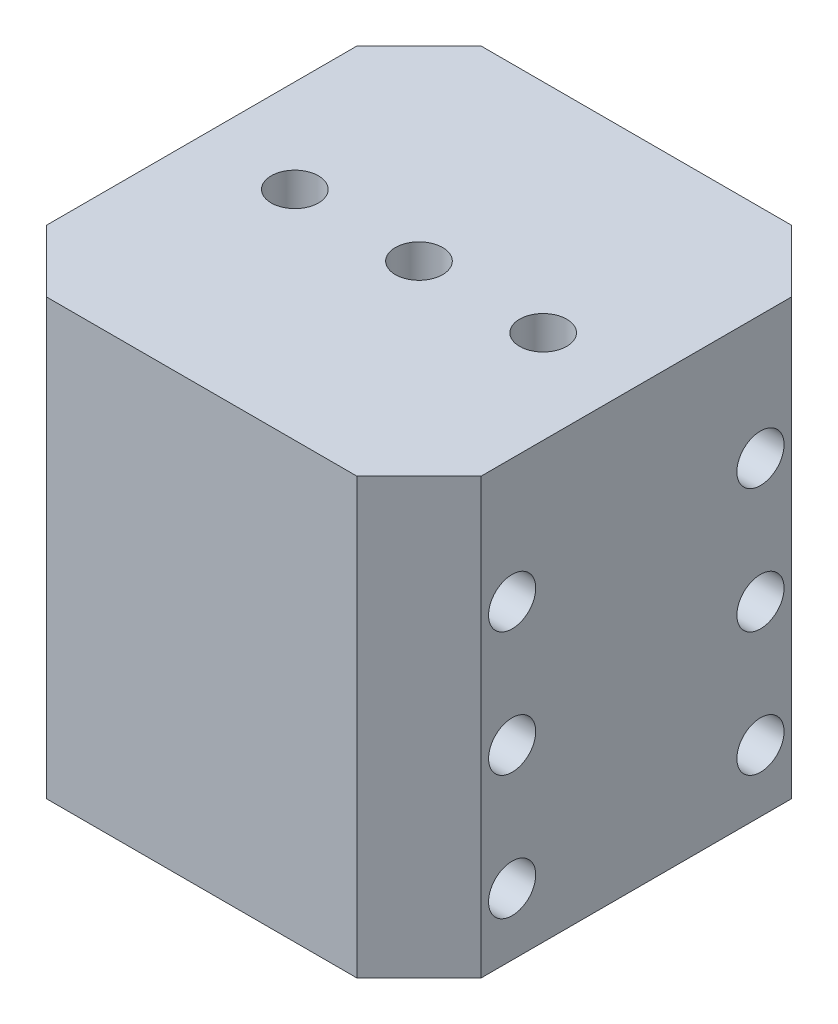
ISO-10303-21;
HEADER;
FILE_DESCRIPTION(('STEP AP214'),'2;1');
FILE_NAME('part.step','',(''),(''),'','','');
FILE_SCHEMA(('AUTOMOTIVE_DESIGN { 1 0 10303 214 1 1 1 1 }'));
ENDSEC;
DATA;
#1=APPLICATION_CONTEXT('core data for automotive mechanical design processes');
#2=APPLICATION_PROTOCOL_DEFINITION('international standard','automotive_design',2000,#1);
#3=PRODUCT_CONTEXT('',#1,'mechanical');
#4=PRODUCT('Part','Part','',(#3));
#5=PRODUCT_RELATED_PRODUCT_CATEGORY('part','',(#4));
#6=PRODUCT_DEFINITION_FORMATION('','',#4);
#7=PRODUCT_DEFINITION_CONTEXT('part definition',#1,'design');
#8=PRODUCT_DEFINITION('design','',#6,#7);
#9=PRODUCT_DEFINITION_SHAPE('','',#8);
#10=(LENGTH_UNIT() NAMED_UNIT(*) SI_UNIT(.MILLI.,.METRE.));
#11=(NAMED_UNIT(*) PLANE_ANGLE_UNIT() SI_UNIT($,.RADIAN.));
#12=(NAMED_UNIT(*) SI_UNIT($,.STERADIAN.) SOLID_ANGLE_UNIT());
#13=UNCERTAINTY_MEASURE_WITH_UNIT(LENGTH_MEASURE(1.E-05),#10,'distance_accuracy_value','');
#14=(GEOMETRIC_REPRESENTATION_CONTEXT(3) GLOBAL_UNCERTAINTY_ASSIGNED_CONTEXT((#13)) GLOBAL_UNIT_ASSIGNED_CONTEXT((#10,
#11,#12)) REPRESENTATION_CONTEXT('',''));
#15=CARTESIAN_POINT('',(0.,0.,0.));
#16=DIRECTION('',(0.,0.,1.));
#17=DIRECTION('',(1.,0.,0.));
#18=AXIS2_PLACEMENT_3D('',#15,#16,#17);
#19=CARTESIAN_POINT('',(0.,44.45,0.));
#20=DIRECTION('',(0.,-1.,0.));
#21=DIRECTION('',(0.,0.,-1.));
#22=AXIS2_PLACEMENT_3D('',#19,#20,#21);
#23=PLANE('',#22);
#24=DIRECTION('',(0.,0.,1.));
#25=VECTOR('',#24,1.);
#26=CARTESIAN_POINT('',(0.,44.45,-6.35));
#27=LINE('',#26,#25);
#28=CARTESIAN_POINT('',(0.,44.45,-38.1));
#29=VERTEX_POINT('',#28);
#30=CARTESIAN_POINT('',(0.,44.45,-6.35));
#31=VERTEX_POINT('',#30);
#32=EDGE_CURVE('E170',#29,#31,#27,.T.);
#33=ORIENTED_EDGE('',*,*,#32,.T.);
#34=DIRECTION('',(0.707106781186547,0.,0.707106781186547));
#35=VECTOR('',#34,1.);
#36=CARTESIAN_POINT('',(0.,44.45,-6.35));
#37=LINE('',#36,#35);
#38=CARTESIAN_POINT('',(6.35,44.45,0.));
#39=VERTEX_POINT('',#38);
#40=EDGE_CURVE('E106',#31,#39,#37,.T.);
#41=ORIENTED_EDGE('',*,*,#40,.T.);
#42=DIRECTION('',(1.,0.,0.));
#43=VECTOR('',#42,1.);
#44=CARTESIAN_POINT('',(6.35,44.45,0.));
#45=LINE('',#44,#43);
#46=CARTESIAN_POINT('',(38.1,44.45,0.));
#47=VERTEX_POINT('',#46);
#48=EDGE_CURVE('E191',#39,#47,#45,.T.);
#49=ORIENTED_EDGE('',*,*,#48,.T.);
#50=DIRECTION('',(0.707106781186548,0.,-0.707106781186547));
#51=VECTOR('',#50,1.);
#52=CARTESIAN_POINT('',(38.1,44.45,0.));
#53=LINE('',#52,#51);
#54=CARTESIAN_POINT('',(44.45,44.45,-6.35));
#55=VERTEX_POINT('',#54);
#56=EDGE_CURVE('E205',#47,#55,#53,.T.);
#57=ORIENTED_EDGE('',*,*,#56,.T.);
#58=DIRECTION('',(0.,0.,-1.));
#59=VECTOR('',#58,1.);
#60=CARTESIAN_POINT('',(44.45,44.45,-6.35));
#61=LINE('',#60,#59);
#62=CARTESIAN_POINT('',(44.45,44.45,-38.1));
#63=VERTEX_POINT('',#62);
#64=EDGE_CURVE('E125',#55,#63,#61,.T.);
#65=ORIENTED_EDGE('',*,*,#64,.T.);
#66=DIRECTION('',(-0.707106781186547,0.,-0.707106781186547));
#67=VECTOR('',#66,1.);
#68=CARTESIAN_POINT('',(38.1,44.45,-44.45));
#69=LINE('',#68,#67);
#70=CARTESIAN_POINT('',(38.1,44.45,-44.45));
#71=VERTEX_POINT('',#70);
#72=EDGE_CURVE('E119',#63,#71,#69,.T.);
#73=ORIENTED_EDGE('',*,*,#72,.T.);
#74=DIRECTION('',(-1.,0.,0.));
#75=VECTOR('',#74,1.);
#76=CARTESIAN_POINT('',(6.35,44.45,-44.45));
#77=LINE('',#76,#75);
#78=CARTESIAN_POINT('',(6.35,44.45,-44.45));
#79=VERTEX_POINT('',#78);
#80=EDGE_CURVE('E123',#71,#79,#77,.T.);
#81=ORIENTED_EDGE('',*,*,#80,.T.);
#82=DIRECTION('',(-0.707106781186547,0.,0.707106781186548));
#83=VECTOR('',#82,1.);
#84=CARTESIAN_POINT('',(0.,44.45,-38.1));
#85=LINE('',#84,#83);
#86=EDGE_CURVE('E63',#79,#29,#85,.T.);
#87=ORIENTED_EDGE('',*,*,#86,.T.);
#88=EDGE_LOOP('',(#33,#41,#49,#57,#65,#73,#81,#87));
#89=FACE_BOUND('',#88,.T.);
#90=CARTESIAN_POINT('',(9.525,44.45,-22.225));
#91=DIRECTION('',(0.,1.,0.));
#92=DIRECTION('',(0.,0.,1.));
#93=AXIS2_PLACEMENT_3D('',#90,#91,#92);
#94=CIRCLE('',#93,2.413);
#95=CARTESIAN_POINT('',(9.525,44.45,-19.812));
#96=VERTEX_POINT('',#95);
#97=EDGE_CURVE('E152',#96,#96,#94,.T.);
#98=ORIENTED_EDGE('',*,*,#97,.F.);
#99=EDGE_LOOP('',(#98));
#100=FACE_BOUND('',#99,.T.);
#101=CARTESIAN_POINT('',(22.225,44.45,-22.225));
#102=DIRECTION('',(0.,1.,0.));
#103=DIRECTION('',(0.,0.,1.));
#104=AXIS2_PLACEMENT_3D('',#101,#102,#103);
#105=CIRCLE('',#104,2.413);
#106=CARTESIAN_POINT('',(22.225,44.45,-19.812));
#107=VERTEX_POINT('',#106);
#108=EDGE_CURVE('E219',#107,#107,#105,.T.);
#109=ORIENTED_EDGE('',*,*,#108,.F.);
#110=EDGE_LOOP('',(#109));
#111=FACE_BOUND('',#110,.T.);
#112=CARTESIAN_POINT('',(34.925,44.45,-22.225));
#113=DIRECTION('',(0.,1.,0.));
#114=DIRECTION('',(0.,0.,1.));
#115=AXIS2_PLACEMENT_3D('',#112,#113,#114);
#116=CIRCLE('',#115,2.413);
#117=CARTESIAN_POINT('',(34.925,44.45,-19.812));
#118=VERTEX_POINT('',#117);
#119=EDGE_CURVE('E227',#118,#118,#116,.T.);
#120=ORIENTED_EDGE('',*,*,#119,.F.);
#121=EDGE_LOOP('',(#120));
#122=FACE_BOUND('',#121,.T.);
#123=ADVANCED_FACE('F45',(#89,#100,#111,#122),#23,.F.);
#124=CARTESIAN_POINT('',(0.,0.,0.));
#125=DIRECTION('',(0.,-1.,0.));
#126=DIRECTION('',(0.,0.,-1.));
#127=AXIS2_PLACEMENT_3D('',#124,#125,#126);
#128=PLANE('',#127);
#129=CARTESIAN_POINT('',(22.225,0.,-22.225));
#130=DIRECTION('',(0.,1.,0.));
#131=DIRECTION('',(0.,0.,1.));
#132=AXIS2_PLACEMENT_3D('',#129,#130,#131);
#133=CIRCLE('',#132,2.413);
#134=CARTESIAN_POINT('',(22.225,0.,-19.812));
#135=VERTEX_POINT('',#134);
#136=EDGE_CURVE('E223',#135,#135,#133,.T.);
#137=ORIENTED_EDGE('',*,*,#136,.T.);
#138=EDGE_LOOP('',(#137));
#139=FACE_BOUND('',#138,.T.);
#140=DIRECTION('',(0.,0.,1.));
#141=VECTOR('',#140,1.);
#142=CARTESIAN_POINT('',(0.,0.,-6.35));
#143=LINE('',#142,#141);
#144=CARTESIAN_POINT('',(0.,0.,-38.1));
#145=VERTEX_POINT('',#144);
#146=CARTESIAN_POINT('',(0.,0.,-6.35));
#147=VERTEX_POINT('',#146);
#148=EDGE_CURVE('E147',#145,#147,#143,.T.);
#149=ORIENTED_EDGE('',*,*,#148,.F.);
#150=DIRECTION('',(-0.707106781186547,0.,0.707106781186548));
#151=VECTOR('',#150,1.);
#152=CARTESIAN_POINT('',(0.,0.,-38.1));
#153=LINE('',#152,#151);
#154=CARTESIAN_POINT('',(6.35,0.,-44.45));
#155=VERTEX_POINT('',#154);
#156=EDGE_CURVE('E98',#155,#145,#153,.T.);
#157=ORIENTED_EDGE('',*,*,#156,.F.);
#158=DIRECTION('',(-1.,0.,0.));
#159=VECTOR('',#158,1.);
#160=CARTESIAN_POINT('',(6.35,0.,-44.45));
#161=LINE('',#160,#159);
#162=CARTESIAN_POINT('',(38.1,0.,-44.45));
#163=VERTEX_POINT('',#162);
#164=EDGE_CURVE('E92',#163,#155,#161,.T.);
#165=ORIENTED_EDGE('',*,*,#164,.F.);
#166=DIRECTION('',(-0.707106781186547,0.,-0.707106781186547));
#167=VECTOR('',#166,1.);
#168=CARTESIAN_POINT('',(38.1,0.,-44.45));
#169=LINE('',#168,#167);
#170=CARTESIAN_POINT('',(44.45,0.,-38.1));
#171=VERTEX_POINT('',#170);
#172=EDGE_CURVE('E134',#171,#163,#169,.T.);
#173=ORIENTED_EDGE('',*,*,#172,.F.);
#174=DIRECTION('',(0.,0.,-1.));
#175=VECTOR('',#174,1.);
#176=CARTESIAN_POINT('',(44.45,0.,-6.35));
#177=LINE('',#176,#175);
#178=CARTESIAN_POINT('',(44.45,0.,-6.35));
#179=VERTEX_POINT('',#178);
#180=EDGE_CURVE('E161',#179,#171,#177,.T.);
#181=ORIENTED_EDGE('',*,*,#180,.F.);
#182=DIRECTION('',(0.707106781186548,0.,-0.707106781186547));
#183=VECTOR('',#182,1.);
#184=CARTESIAN_POINT('',(38.1,0.,0.));
#185=LINE('',#184,#183);
#186=CARTESIAN_POINT('',(38.1,0.,0.));
#187=VERTEX_POINT('',#186);
#188=EDGE_CURVE('E158',#187,#179,#185,.T.);
#189=ORIENTED_EDGE('',*,*,#188,.F.);
#190=DIRECTION('',(1.,0.,0.));
#191=VECTOR('',#190,1.);
#192=CARTESIAN_POINT('',(6.35,0.,0.));
#193=LINE('',#192,#191);
#194=CARTESIAN_POINT('',(6.35,0.,0.));
#195=VERTEX_POINT('',#194);
#196=EDGE_CURVE('E155',#195,#187,#193,.T.);
#197=ORIENTED_EDGE('',*,*,#196,.F.);
#198=DIRECTION('',(0.707106781186547,0.,0.707106781186547));
#199=VECTOR('',#198,1.);
#200=CARTESIAN_POINT('',(0.,0.,-6.35));
#201=LINE('',#200,#199);
#202=EDGE_CURVE('E151',#147,#195,#201,.T.);
#203=ORIENTED_EDGE('',*,*,#202,.F.);
#204=EDGE_LOOP('',(#149,#157,#165,#173,#181,#189,#197,#203));
#205=FACE_BOUND('',#204,.T.);
#206=CARTESIAN_POINT('',(9.525,0.,-22.225));
#207=DIRECTION('',(0.,1.,0.));
#208=DIRECTION('',(0.,0.,1.));
#209=AXIS2_PLACEMENT_3D('',#206,#207,#208);
#210=CIRCLE('',#209,2.413);
#211=CARTESIAN_POINT('',(9.525,0.,-19.812));
#212=VERTEX_POINT('',#211);
#213=EDGE_CURVE('E215',#212,#212,#210,.T.);
#214=ORIENTED_EDGE('',*,*,#213,.T.);
#215=EDGE_LOOP('',(#214));
#216=FACE_BOUND('',#215,.T.);
#217=CARTESIAN_POINT('',(34.925,0.,-22.225));
#218=DIRECTION('',(0.,1.,0.));
#219=DIRECTION('',(0.,0.,1.));
#220=AXIS2_PLACEMENT_3D('',#217,#218,#219);
#221=CIRCLE('',#220,2.413);
#222=CARTESIAN_POINT('',(34.925,0.,-19.812));
#223=VERTEX_POINT('',#222);
#224=EDGE_CURVE('E231',#223,#223,#221,.T.);
#225=ORIENTED_EDGE('',*,*,#224,.T.);
#226=EDGE_LOOP('',(#225));
#227=FACE_BOUND('',#226,.T.);
#228=ADVANCED_FACE('F195',(#139,#205,#216,#227),#128,.T.);
#229=CARTESIAN_POINT('',(0.,44.45,-6.35));
#230=DIRECTION('',(1.,0.,0.));
#231=DIRECTION('',(0.,0.,-1.));
#232=AXIS2_PLACEMENT_3D('',#229,#230,#231);
#233=PLANE('',#232);
#234=CARTESIAN_POINT('',(0.,31.75,-34.925));
#235=DIRECTION('',(1.,0.,0.));
#236=DIRECTION('',(0.,0.,-1.));
#237=AXIS2_PLACEMENT_3D('',#234,#235,#236);
#238=CIRCLE('',#237,2.41299999999999);
#239=CARTESIAN_POINT('',(0.,31.75,-37.338));
#240=VERTEX_POINT('',#239);
#241=EDGE_CURVE('E235',#240,#240,#238,.T.);
#242=ORIENTED_EDGE('',*,*,#241,.T.);
#243=EDGE_LOOP('',(#242));
#244=FACE_BOUND('',#243,.T.);
#245=CARTESIAN_POINT('',(0.,6.35,-34.925));
#246=DIRECTION('',(1.,0.,0.));
#247=DIRECTION('',(0.,0.,-1.));
#248=AXIS2_PLACEMENT_3D('',#245,#246,#247);
#249=CIRCLE('',#248,2.413);
#250=CARTESIAN_POINT('',(0.,6.35,-37.338));
#251=VERTEX_POINT('',#250);
#252=EDGE_CURVE('E242',#251,#251,#249,.T.);
#253=ORIENTED_EDGE('',*,*,#252,.T.);
#254=EDGE_LOOP('',(#253));
#255=FACE_BOUND('',#254,.T.);
#256=CARTESIAN_POINT('',(0.,6.35,-9.525));
#257=DIRECTION('',(1.,0.,0.));
#258=DIRECTION('',(0.,0.,-1.));
#259=AXIS2_PLACEMENT_3D('',#256,#257,#258);
#260=CIRCLE('',#259,2.413);
#261=CARTESIAN_POINT('',(0.,6.35,-11.938));
#262=VERTEX_POINT('',#261);
#263=EDGE_CURVE('E246',#262,#262,#260,.T.);
#264=ORIENTED_EDGE('',*,*,#263,.T.);
#265=EDGE_LOOP('',(#264));
#266=FACE_BOUND('',#265,.T.);
#267=CARTESIAN_POINT('',(0.,19.05,-9.525));
#268=DIRECTION('',(1.,0.,0.));
#269=DIRECTION('',(0.,0.,-1.));
#270=AXIS2_PLACEMENT_3D('',#267,#268,#269);
#271=CIRCLE('',#270,2.413);
#272=CARTESIAN_POINT('',(0.,19.05,-11.938));
#273=VERTEX_POINT('',#272);
#274=EDGE_CURVE('E250',#273,#273,#271,.T.);
#275=ORIENTED_EDGE('',*,*,#274,.T.);
#276=EDGE_LOOP('',(#275));
#277=FACE_BOUND('',#276,.T.);
#278=CARTESIAN_POINT('',(0.,19.05,-34.925));
#279=DIRECTION('',(1.,0.,0.));
#280=DIRECTION('',(0.,0.,-1.));
#281=AXIS2_PLACEMENT_3D('',#278,#279,#280);
#282=CIRCLE('',#281,2.413);
#283=CARTESIAN_POINT('',(0.,19.05,-37.338));
#284=VERTEX_POINT('',#283);
#285=EDGE_CURVE('E254',#284,#284,#282,.T.);
#286=ORIENTED_EDGE('',*,*,#285,.T.);
#287=EDGE_LOOP('',(#286));
#288=FACE_BOUND('',#287,.T.);
#289=CARTESIAN_POINT('',(0.,31.75,-9.525));
#290=DIRECTION('',(1.,0.,0.));
#291=DIRECTION('',(0.,0.,-1.));
#292=AXIS2_PLACEMENT_3D('',#289,#290,#291);
#293=CIRCLE('',#292,2.413);
#294=CARTESIAN_POINT('',(0.,31.75,-11.938));
#295=VERTEX_POINT('',#294);
#296=EDGE_CURVE('E258',#295,#295,#293,.T.);
#297=ORIENTED_EDGE('',*,*,#296,.T.);
#298=EDGE_LOOP('',(#297));
#299=FACE_BOUND('',#298,.T.);
#300=ORIENTED_EDGE('',*,*,#148,.T.);
#301=DIRECTION('',(0.,-1.,0.));
#302=VECTOR('',#301,1.);
#303=CARTESIAN_POINT('',(0.,44.45,-6.35));
#304=LINE('',#303,#302);
#305=EDGE_CURVE('E11',#31,#147,#304,.T.);
#306=ORIENTED_EDGE('',*,*,#305,.F.);
#307=ORIENTED_EDGE('',*,*,#32,.F.);
#308=DIRECTION('',(0.,-1.,0.));
#309=VECTOR('',#308,1.);
#310=CARTESIAN_POINT('',(0.,44.45,-38.1));
#311=LINE('',#310,#309);
#312=EDGE_CURVE('E143',#29,#145,#311,.T.);
#313=ORIENTED_EDGE('',*,*,#312,.T.);
#314=EDGE_LOOP('',(#300,#306,#307,#313));
#315=FACE_BOUND('',#314,.T.);
#316=ADVANCED_FACE('F47',(#244,#255,#266,#277,#288,#299,#315),#233,.F.);
#317=CARTESIAN_POINT('',(0.,44.45,-6.35));
#318=DIRECTION('',(0.707106781186547,0.,-0.707106781186547));
#319=DIRECTION('',(-0.707106781186548,0.,-0.707106781186548));
#320=AXIS2_PLACEMENT_3D('',#317,#318,#319);
#321=PLANE('',#320);
#322=ORIENTED_EDGE('',*,*,#202,.T.);
#323=DIRECTION('',(0.,-1.,0.));
#324=VECTOR('',#323,1.);
#325=CARTESIAN_POINT('',(6.35,44.45,0.));
#326=LINE('',#325,#324);
#327=EDGE_CURVE('E55',#39,#195,#326,.T.);
#328=ORIENTED_EDGE('',*,*,#327,.F.);
#329=ORIENTED_EDGE('',*,*,#40,.F.);
#330=ORIENTED_EDGE('',*,*,#305,.T.);
#331=EDGE_LOOP('',(#322,#328,#329,#330));
#332=FACE_BOUND('',#331,.T.);
#333=ADVANCED_FACE('F305',(#332),#321,.F.);
#334=CARTESIAN_POINT('',(6.35,44.45,0.));
#335=DIRECTION('',(0.,0.,-1.));
#336=DIRECTION('',(-1.,0.,0.));
#337=AXIS2_PLACEMENT_3D('',#334,#335,#336);
#338=PLANE('',#337);
#339=ORIENTED_EDGE('',*,*,#196,.T.);
#340=DIRECTION('',(0.,-1.,0.));
#341=VECTOR('',#340,1.);
#342=CARTESIAN_POINT('',(38.1,44.45,0.));
#343=LINE('',#342,#341);
#344=EDGE_CURVE('E181',#47,#187,#343,.T.);
#345=ORIENTED_EDGE('',*,*,#344,.F.);
#346=ORIENTED_EDGE('',*,*,#48,.F.);
#347=ORIENTED_EDGE('',*,*,#327,.T.);
#348=EDGE_LOOP('',(#339,#345,#346,#347));
#349=FACE_BOUND('',#348,.T.);
#350=ADVANCED_FACE('F189',(#349),#338,.F.);
#351=CARTESIAN_POINT('',(38.1,44.45,0.));
#352=DIRECTION('',(-0.707106781186547,0.,-0.707106781186548));
#353=DIRECTION('',(-0.707106781186548,0.,0.707106781186547));
#354=AXIS2_PLACEMENT_3D('',#351,#352,#353);
#355=PLANE('',#354);
#356=ORIENTED_EDGE('',*,*,#188,.T.);
#357=DIRECTION('',(0.,-1.,0.));
#358=VECTOR('',#357,1.);
#359=CARTESIAN_POINT('',(44.45,44.45,-6.35));
#360=LINE('',#359,#358);
#361=EDGE_CURVE('E177',#55,#179,#360,.T.);
#362=ORIENTED_EDGE('',*,*,#361,.F.);
#363=ORIENTED_EDGE('',*,*,#56,.F.);
#364=ORIENTED_EDGE('',*,*,#344,.T.);
#365=EDGE_LOOP('',(#356,#362,#363,#364));
#366=FACE_BOUND('',#365,.T.);
#367=ADVANCED_FACE('F200',(#366),#355,.F.);
#368=CARTESIAN_POINT('',(44.45,44.45,-6.35));
#369=DIRECTION('',(-1.,0.,0.));
#370=DIRECTION('',(0.,0.,1.));
#371=AXIS2_PLACEMENT_3D('',#368,#369,#370);
#372=PLANE('',#371);
#373=CARTESIAN_POINT('',(44.45,31.75,-34.925));
#374=DIRECTION('',(1.,0.,0.));
#375=DIRECTION('',(0.,0.,-1.));
#376=AXIS2_PLACEMENT_3D('',#373,#374,#375);
#377=CIRCLE('',#376,2.41299999999999);
#378=CARTESIAN_POINT('',(44.45,31.75,-37.338));
#379=VERTEX_POINT('',#378);
#380=EDGE_CURVE('E266',#379,#379,#377,.T.);
#381=ORIENTED_EDGE('',*,*,#380,.F.);
#382=EDGE_LOOP('',(#381));
#383=FACE_BOUND('',#382,.T.);
#384=CARTESIAN_POINT('',(44.45,6.35,-34.925));
#385=DIRECTION('',(1.,0.,0.));
#386=DIRECTION('',(0.,0.,-1.));
#387=AXIS2_PLACEMENT_3D('',#384,#385,#386);
#388=CIRCLE('',#387,2.413);
#389=CARTESIAN_POINT('',(44.45,6.35,-37.338));
#390=VERTEX_POINT('',#389);
#391=EDGE_CURVE('E276',#390,#390,#388,.T.);
#392=ORIENTED_EDGE('',*,*,#391,.F.);
#393=EDGE_LOOP('',(#392));
#394=FACE_BOUND('',#393,.T.);
#395=CARTESIAN_POINT('',(44.45,6.35,-9.525));
#396=DIRECTION('',(1.,0.,0.));
#397=DIRECTION('',(0.,0.,-1.));
#398=AXIS2_PLACEMENT_3D('',#395,#396,#397);
#399=CIRCLE('',#398,2.413);
#400=CARTESIAN_POINT('',(44.45,6.35,-11.938));
#401=VERTEX_POINT('',#400);
#402=EDGE_CURVE('E271',#401,#401,#399,.T.);
#403=ORIENTED_EDGE('',*,*,#402,.F.);
#404=EDGE_LOOP('',(#403));
#405=FACE_BOUND('',#404,.T.);
#406=CARTESIAN_POINT('',(44.45,19.05,-9.525));
#407=DIRECTION('',(1.,0.,0.));
#408=DIRECTION('',(0.,0.,-1.));
#409=AXIS2_PLACEMENT_3D('',#406,#407,#408);
#410=CIRCLE('',#409,2.413);
#411=CARTESIAN_POINT('',(44.45,19.05,-11.938));
#412=VERTEX_POINT('',#411);
#413=EDGE_CURVE('E267',#412,#412,#410,.T.);
#414=ORIENTED_EDGE('',*,*,#413,.F.);
#415=EDGE_LOOP('',(#414));
#416=FACE_BOUND('',#415,.T.);
#417=CARTESIAN_POINT('',(44.45,19.05,-34.925));
#418=DIRECTION('',(1.,0.,0.));
#419=DIRECTION('',(0.,0.,-1.));
#420=AXIS2_PLACEMENT_3D('',#417,#418,#419);
#421=CIRCLE('',#420,2.413);
#422=CARTESIAN_POINT('',(44.45,19.05,-37.338));
#423=VERTEX_POINT('',#422);
#424=EDGE_CURVE('E272',#423,#423,#421,.T.);
#425=ORIENTED_EDGE('',*,*,#424,.F.);
#426=EDGE_LOOP('',(#425));
#427=FACE_BOUND('',#426,.T.);
#428=CARTESIAN_POINT('',(44.45,31.75,-9.525));
#429=DIRECTION('',(1.,0.,0.));
#430=DIRECTION('',(0.,0.,-1.));
#431=AXIS2_PLACEMENT_3D('',#428,#429,#430);
#432=CIRCLE('',#431,2.413);
#433=CARTESIAN_POINT('',(44.45,31.75,-11.938));
#434=VERTEX_POINT('',#433);
#435=EDGE_CURVE('E262',#434,#434,#432,.T.);
#436=ORIENTED_EDGE('',*,*,#435,.F.);
#437=EDGE_LOOP('',(#436));
#438=FACE_BOUND('',#437,.T.);
#439=ORIENTED_EDGE('',*,*,#180,.T.);
#440=DIRECTION('',(0.,-1.,0.));
#441=VECTOR('',#440,1.);
#442=CARTESIAN_POINT('',(44.45,44.45,-38.1));
#443=LINE('',#442,#441);
#444=EDGE_CURVE('E136',#63,#171,#443,.T.);
#445=ORIENTED_EDGE('',*,*,#444,.F.);
#446=ORIENTED_EDGE('',*,*,#64,.F.);
#447=ORIENTED_EDGE('',*,*,#361,.T.);
#448=EDGE_LOOP('',(#439,#445,#446,#447));
#449=FACE_BOUND('',#448,.T.);
#450=ADVANCED_FACE('F203',(#383,#394,#405,#416,#427,#438,#449),#372,.F.);
#451=CARTESIAN_POINT('',(38.1,44.45,-44.45));
#452=DIRECTION('',(-0.707106781186547,0.,0.707106781186547));
#453=DIRECTION('',(0.707106781186548,0.,0.707106781186548));
#454=AXIS2_PLACEMENT_3D('',#451,#452,#453);
#455=PLANE('',#454);
#456=ORIENTED_EDGE('',*,*,#172,.T.);
#457=DIRECTION('',(0.,-1.,0.));
#458=VECTOR('',#457,1.);
#459=CARTESIAN_POINT('',(38.1,44.45,-44.45));
#460=LINE('',#459,#458);
#461=EDGE_CURVE('E131',#71,#163,#460,.T.);
#462=ORIENTED_EDGE('',*,*,#461,.F.);
#463=ORIENTED_EDGE('',*,*,#72,.F.);
#464=ORIENTED_EDGE('',*,*,#444,.T.);
#465=EDGE_LOOP('',(#456,#462,#463,#464));
#466=FACE_BOUND('',#465,.T.);
#467=ADVANCED_FACE('F132',(#466),#455,.F.);
#468=CARTESIAN_POINT('',(6.35,44.45,-44.45));
#469=DIRECTION('',(0.,0.,1.));
#470=DIRECTION('',(1.,0.,0.));
#471=AXIS2_PLACEMENT_3D('',#468,#469,#470);
#472=PLANE('',#471);
#473=ORIENTED_EDGE('',*,*,#164,.T.);
#474=DIRECTION('',(0.,-1.,0.));
#475=VECTOR('',#474,1.);
#476=CARTESIAN_POINT('',(6.35,44.45,-44.45));
#477=LINE('',#476,#475);
#478=EDGE_CURVE('E137',#79,#155,#477,.T.);
#479=ORIENTED_EDGE('',*,*,#478,.F.);
#480=ORIENTED_EDGE('',*,*,#80,.F.);
#481=ORIENTED_EDGE('',*,*,#461,.T.);
#482=EDGE_LOOP('',(#473,#479,#480,#481));
#483=FACE_BOUND('',#482,.T.);
#484=ADVANCED_FACE('F139',(#483),#472,.F.);
#485=CARTESIAN_POINT('',(0.,44.45,-38.1));
#486=DIRECTION('',(0.707106781186548,0.,0.707106781186547));
#487=DIRECTION('',(0.707106781186547,0.,-0.707106781186548));
#488=AXIS2_PLACEMENT_3D('',#485,#486,#487);
#489=PLANE('',#488);
#490=ORIENTED_EDGE('',*,*,#156,.T.);
#491=ORIENTED_EDGE('',*,*,#312,.F.);
#492=ORIENTED_EDGE('',*,*,#86,.F.);
#493=ORIENTED_EDGE('',*,*,#478,.T.);
#494=EDGE_LOOP('',(#490,#491,#492,#493));
#495=FACE_BOUND('',#494,.T.);
#496=ADVANCED_FACE('F309',(#495),#489,.F.);
#497=CARTESIAN_POINT('',(9.525,44.45,-22.225));
#498=DIRECTION('',(0.,-1.,0.));
#499=DIRECTION('',(0.,0.,-1.));
#500=AXIS2_PLACEMENT_3D('',#497,#498,#499);
#501=CYLINDRICAL_SURFACE('',#500,2.413);
#502=ORIENTED_EDGE('',*,*,#97,.T.);
#503=EDGE_LOOP('',(#502));
#504=FACE_BOUND('',#503,.T.);
#505=ORIENTED_EDGE('',*,*,#213,.F.);
#506=EDGE_LOOP('',(#505));
#507=FACE_BOUND('',#506,.T.);
#508=ADVANCED_FACE('F311',(#504,#507),#501,.F.);
#509=CARTESIAN_POINT('',(22.225,44.45,-22.225));
#510=DIRECTION('',(0.,-1.,0.));
#511=DIRECTION('',(0.,0.,-1.));
#512=AXIS2_PLACEMENT_3D('',#509,#510,#511);
#513=CYLINDRICAL_SURFACE('',#512,2.413);
#514=ORIENTED_EDGE('',*,*,#108,.T.);
#515=EDGE_LOOP('',(#514));
#516=FACE_BOUND('',#515,.T.);
#517=ORIENTED_EDGE('',*,*,#136,.F.);
#518=EDGE_LOOP('',(#517));
#519=FACE_BOUND('',#518,.T.);
#520=ADVANCED_FACE('F317',(#516,#519),#513,.F.);
#521=CARTESIAN_POINT('',(34.925,44.45,-22.225));
#522=DIRECTION('',(0.,-1.,0.));
#523=DIRECTION('',(0.,0.,-1.));
#524=AXIS2_PLACEMENT_3D('',#521,#522,#523);
#525=CYLINDRICAL_SURFACE('',#524,2.413);
#526=ORIENTED_EDGE('',*,*,#119,.T.);
#527=EDGE_LOOP('',(#526));
#528=FACE_BOUND('',#527,.T.);
#529=ORIENTED_EDGE('',*,*,#224,.F.);
#530=EDGE_LOOP('',(#529));
#531=FACE_BOUND('',#530,.T.);
#532=ADVANCED_FACE('F299',(#528,#531),#525,.F.);
#533=CARTESIAN_POINT('',(-6.35,31.75,-9.525));
#534=DIRECTION('',(1.,0.,0.));
#535=DIRECTION('',(0.,0.,-1.));
#536=AXIS2_PLACEMENT_3D('',#533,#534,#535);
#537=CYLINDRICAL_SURFACE('',#536,2.413);
#538=ORIENTED_EDGE('',*,*,#435,.T.);
#539=EDGE_LOOP('',(#538));
#540=FACE_BOUND('',#539,.T.);
#541=ORIENTED_EDGE('',*,*,#296,.F.);
#542=EDGE_LOOP('',(#541));
#543=FACE_BOUND('',#542,.T.);
#544=ADVANCED_FACE('F296',(#540,#543),#537,.F.);
#545=CARTESIAN_POINT('',(-6.35,19.05,-34.925));
#546=DIRECTION('',(1.,0.,0.));
#547=DIRECTION('',(0.,0.,-1.));
#548=AXIS2_PLACEMENT_3D('',#545,#546,#547);
#549=CYLINDRICAL_SURFACE('',#548,2.413);
#550=ORIENTED_EDGE('',*,*,#424,.T.);
#551=EDGE_LOOP('',(#550));
#552=FACE_BOUND('',#551,.T.);
#553=ORIENTED_EDGE('',*,*,#285,.F.);
#554=EDGE_LOOP('',(#553));
#555=FACE_BOUND('',#554,.T.);
#556=ADVANCED_FACE('F287',(#552,#555),#549,.F.);
#557=CARTESIAN_POINT('',(-6.35,19.05,-9.525));
#558=DIRECTION('',(1.,0.,0.));
#559=DIRECTION('',(0.,0.,-1.));
#560=AXIS2_PLACEMENT_3D('',#557,#558,#559);
#561=CYLINDRICAL_SURFACE('',#560,2.413);
#562=ORIENTED_EDGE('',*,*,#413,.T.);
#563=EDGE_LOOP('',(#562));
#564=FACE_BOUND('',#563,.T.);
#565=ORIENTED_EDGE('',*,*,#274,.F.);
#566=EDGE_LOOP('',(#565));
#567=FACE_BOUND('',#566,.T.);
#568=ADVANCED_FACE('F335',(#564,#567),#561,.F.);
#569=CARTESIAN_POINT('',(-6.35,6.35,-9.525));
#570=DIRECTION('',(1.,0.,0.));
#571=DIRECTION('',(0.,0.,-1.));
#572=AXIS2_PLACEMENT_3D('',#569,#570,#571);
#573=CYLINDRICAL_SURFACE('',#572,2.413);
#574=ORIENTED_EDGE('',*,*,#402,.T.);
#575=EDGE_LOOP('',(#574));
#576=FACE_BOUND('',#575,.T.);
#577=ORIENTED_EDGE('',*,*,#263,.F.);
#578=EDGE_LOOP('',(#577));
#579=FACE_BOUND('',#578,.T.);
#580=ADVANCED_FACE('F338',(#576,#579),#573,.F.);
#581=CARTESIAN_POINT('',(-6.35,6.35,-34.925));
#582=DIRECTION('',(1.,0.,0.));
#583=DIRECTION('',(0.,0.,-1.));
#584=AXIS2_PLACEMENT_3D('',#581,#582,#583);
#585=CYLINDRICAL_SURFACE('',#584,2.413);
#586=ORIENTED_EDGE('',*,*,#391,.T.);
#587=EDGE_LOOP('',(#586));
#588=FACE_BOUND('',#587,.T.);
#589=ORIENTED_EDGE('',*,*,#252,.F.);
#590=EDGE_LOOP('',(#589));
#591=FACE_BOUND('',#590,.T.);
#592=ADVANCED_FACE('F342',(#588,#591),#585,.F.);
#593=CARTESIAN_POINT('',(-6.35,31.75,-34.925));
#594=DIRECTION('',(1.,0.,0.));
#595=DIRECTION('',(0.,0.,-1.));
#596=AXIS2_PLACEMENT_3D('',#593,#594,#595);
#597=CYLINDRICAL_SURFACE('',#596,2.41299999999999);
#598=ORIENTED_EDGE('',*,*,#380,.T.);
#599=EDGE_LOOP('',(#598));
#600=FACE_BOUND('',#599,.T.);
#601=ORIENTED_EDGE('',*,*,#241,.F.);
#602=EDGE_LOOP('',(#601));
#603=FACE_BOUND('',#602,.T.);
#604=ADVANCED_FACE('F346',(#600,#603),#597,.F.);
#605=CLOSED_SHELL('',(#123,#228,#316,#333,#350,#367,#450,#467,#484,#496,#508,#520,#532,#544,
#556,#568,#580,#592,#604));
#606=MANIFOLD_SOLID_BREP('B2',#605);
#607=ADVANCED_BREP_SHAPE_REPRESENTATION('',(#18,#606),#14);
#608=SHAPE_DEFINITION_REPRESENTATION(#9,#607);
ENDSEC;
END-ISO-10303-21;
